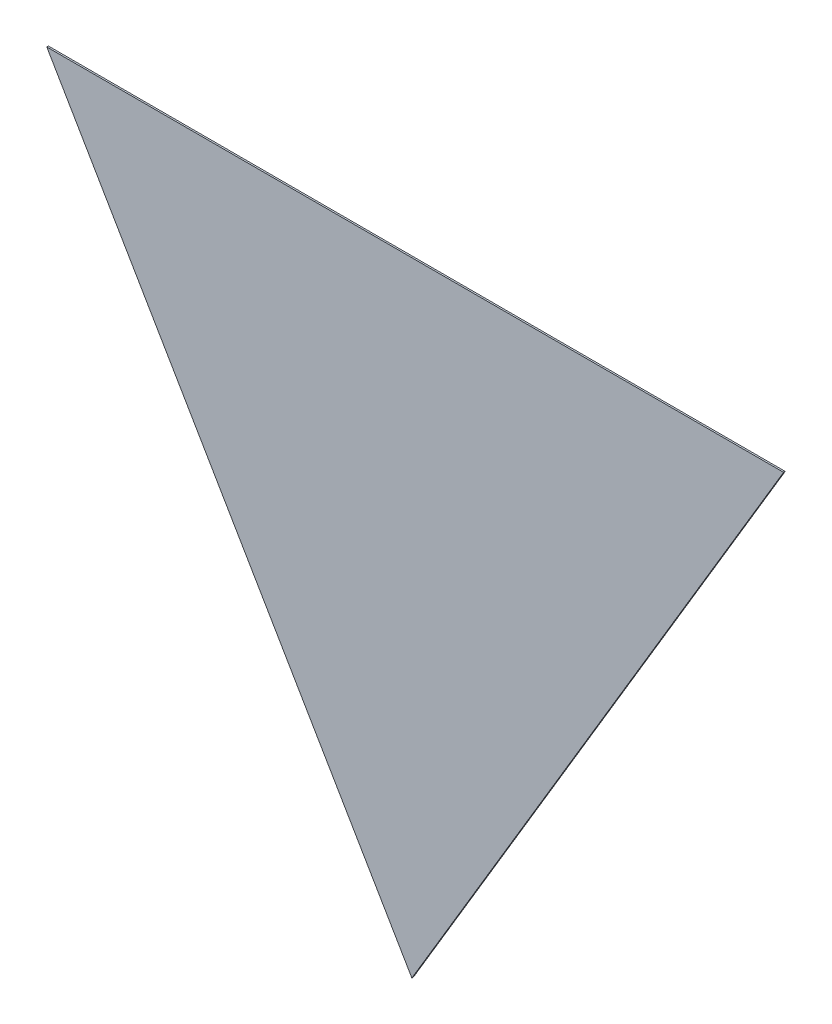
ISO-10303-21;
HEADER;
FILE_DESCRIPTION(('STEP AP214'),'2;1');
FILE_NAME('part.step','',(''),(''),'','','');
FILE_SCHEMA(('AUTOMOTIVE_DESIGN { 1 0 10303 214 1 1 1 1 }'));
ENDSEC;
DATA;
#1=APPLICATION_CONTEXT('core data for automotive mechanical design processes');
#2=APPLICATION_PROTOCOL_DEFINITION('international standard','automotive_design',2000,#1);
#3=PRODUCT_CONTEXT('',#1,'mechanical');
#4=PRODUCT('Part','Part','',(#3));
#5=PRODUCT_RELATED_PRODUCT_CATEGORY('part','',(#4));
#6=PRODUCT_DEFINITION_FORMATION('','',#4);
#7=PRODUCT_DEFINITION_CONTEXT('part definition',#1,'design');
#8=PRODUCT_DEFINITION('design','',#6,#7);
#9=PRODUCT_DEFINITION_SHAPE('','',#8);
#10=(LENGTH_UNIT() NAMED_UNIT(*) SI_UNIT(.MILLI.,.METRE.));
#11=(NAMED_UNIT(*) PLANE_ANGLE_UNIT() SI_UNIT($,.RADIAN.));
#12=(NAMED_UNIT(*) SI_UNIT($,.STERADIAN.) SOLID_ANGLE_UNIT());
#13=UNCERTAINTY_MEASURE_WITH_UNIT(LENGTH_MEASURE(1.E-05),#10,'distance_accuracy_value','');
#14=(GEOMETRIC_REPRESENTATION_CONTEXT(3) GLOBAL_UNCERTAINTY_ASSIGNED_CONTEXT((#13)) GLOBAL_UNIT_ASSIGNED_CONTEXT((#10,
#11,#12)) REPRESENTATION_CONTEXT('',''));
#15=CARTESIAN_POINT('',(0.,0.,0.));
#16=DIRECTION('',(0.,0.,1.));
#17=DIRECTION('',(1.,0.,0.));
#18=AXIS2_PLACEMENT_3D('',#15,#16,#17);
#19=CARTESIAN_POINT('',(0.0542218282260254,0.390044601167,0.0009));
#20=DIRECTION('',(0.859023340627718,-0.511936422084614,0.));
#21=DIRECTION('',(0.,0.,-1.));
#22=AXIS2_PLACEMENT_3D('',#19,#20,#21);
#23=PLANE('',#22);
#24=DIRECTION('',(0.,0.,1.));
#25=VECTOR('',#24,1.);
#26=CARTESIAN_POINT('',(0.1560287683761,0.5608754583869,0.));
#27=LINE('',#26,#25);
#28=CARTESIAN_POINT('',(0.1560287683761,0.5608754583869,0.));
#29=VERTEX_POINT('',#28);
#30=CARTESIAN_POINT('',(0.1560287683761,0.5608754583869,0.0009));
#31=VERTEX_POINT('',#30);
#32=EDGE_CURVE('E11',#29,#31,#27,.T.);
#33=ORIENTED_EDGE('',*,*,#32,.T.);
#34=DIRECTION('',(-0.511936422084614,-0.859023340627718,0.));
#35=VECTOR('',#34,1.);
#36=CARTESIAN_POINT('',(0.1560287683761,0.5608754583869,0.0009));
#37=LINE('',#36,#35);
#38=CARTESIAN_POINT('',(-0.0475851119240491,0.2192137439471,0.0009));
#39=VERTEX_POINT('',#38);
#40=EDGE_CURVE('E69',#31,#39,#37,.T.);
#41=ORIENTED_EDGE('',*,*,#40,.T.);
#42=DIRECTION('',(0.,0.,1.));
#43=VECTOR('',#42,1.);
#44=CARTESIAN_POINT('',(-0.0475851119240491,0.2192137439471,0.));
#45=LINE('',#44,#43);
#46=CARTESIAN_POINT('',(-0.0475851119240491,0.2192137439471,0.));
#47=VERTEX_POINT('',#46);
#48=EDGE_CURVE('E24',#47,#39,#45,.T.);
#49=ORIENTED_EDGE('',*,*,#48,.F.);
#50=DIRECTION('',(-0.511936422084614,-0.859023340627718,0.));
#51=VECTOR('',#50,1.);
#52=CARTESIAN_POINT('',(0.1560287683761,0.5608754583869,0.));
#53=LINE('',#52,#51);
#54=EDGE_CURVE('E47',#29,#47,#53,.T.);
#55=ORIENTED_EDGE('',*,*,#54,.F.);
#56=EDGE_LOOP('',(#33,#41,#49,#55));
#57=FACE_BOUND('',#56,.T.);
#58=ADVANCED_FACE('F17',(#57),#23,.T.);
#59=CARTESIAN_POINT('',(-0.147563556874025,0.390044601167,0.0009));
#60=DIRECTION('',(-0.863058750862992,-0.505103546373229,0.));
#61=DIRECTION('',(0.,0.,1.));
#62=AXIS2_PLACEMENT_3D('',#59,#60,#61);
#63=PLANE('',#62);
#64=ORIENTED_EDGE('',*,*,#48,.T.);
#65=DIRECTION('',(-0.505103546373229,0.863058750862991,0.));
#66=VECTOR('',#65,1.);
#67=CARTESIAN_POINT('',(-0.0475851119240491,0.2192137439471,0.0009));
#68=LINE('',#67,#66);
#69=CARTESIAN_POINT('',(-0.247542001824,0.5608754583869,0.0009));
#70=VERTEX_POINT('',#69);
#71=EDGE_CURVE('E51',#39,#70,#68,.T.);
#72=ORIENTED_EDGE('',*,*,#71,.T.);
#73=DIRECTION('',(0.,0.,1.));
#74=VECTOR('',#73,1.);
#75=CARTESIAN_POINT('',(-0.247542001824,0.5608754583869,0.));
#76=LINE('',#75,#74);
#77=CARTESIAN_POINT('',(-0.247542001824,0.5608754583869,0.));
#78=VERTEX_POINT('',#77);
#79=EDGE_CURVE('E67',#78,#70,#76,.T.);
#80=ORIENTED_EDGE('',*,*,#79,.F.);
#81=DIRECTION('',(-0.505103546373229,0.863058750862991,0.));
#82=VECTOR('',#81,1.);
#83=CARTESIAN_POINT('',(-0.0475851119240491,0.2192137439471,0.));
#84=LINE('',#83,#82);
#85=EDGE_CURVE('E61',#47,#78,#84,.T.);
#86=ORIENTED_EDGE('',*,*,#85,.F.);
#87=EDGE_LOOP('',(#64,#72,#80,#86));
#88=FACE_BOUND('',#87,.T.);
#89=ADVANCED_FACE('F73',(#88),#63,.T.);
#90=CARTESIAN_POINT('',(-0.0457566167239502,0.5608754583869,0.0009));
#91=DIRECTION('',(0.,1.,0.));
#92=DIRECTION('',(0.,0.,1.));
#93=AXIS2_PLACEMENT_3D('',#90,#91,#92);
#94=PLANE('',#93);
#95=ORIENTED_EDGE('',*,*,#79,.T.);
#96=DIRECTION('',(1.,0.,0.));
#97=VECTOR('',#96,1.);
#98=CARTESIAN_POINT('',(-0.247542001824,0.5608754583869,0.0009));
#99=LINE('',#98,#97);
#100=EDGE_CURVE('E52',#70,#31,#99,.T.);
#101=ORIENTED_EDGE('',*,*,#100,.T.);
#102=ORIENTED_EDGE('',*,*,#32,.F.);
#103=DIRECTION('',(1.,0.,0.));
#104=VECTOR('',#103,1.);
#105=CARTESIAN_POINT('',(-0.247542001824,0.5608754583869,0.));
#106=LINE('',#105,#104);
#107=EDGE_CURVE('E57',#78,#29,#106,.T.);
#108=ORIENTED_EDGE('',*,*,#107,.F.);
#109=EDGE_LOOP('',(#95,#101,#102,#108));
#110=FACE_BOUND('',#109,.T.);
#111=ADVANCED_FACE('F56',(#110),#94,.T.);
#112=CARTESIAN_POINT('',(-0.0457566167239502,0.2192137439471,0.));
#113=DIRECTION('',(0.,0.,1.));
#114=DIRECTION('',(1.,0.,0.));
#115=AXIS2_PLACEMENT_3D('',#112,#113,#114);
#116=PLANE('',#115);
#117=ORIENTED_EDGE('',*,*,#54,.T.);
#118=ORIENTED_EDGE('',*,*,#85,.T.);
#119=ORIENTED_EDGE('',*,*,#107,.T.);
#120=EDGE_LOOP('',(#117,#118,#119));
#121=FACE_BOUND('',#120,.T.);
#122=ADVANCED_FACE('F60',(#121),#116,.F.);
#123=CARTESIAN_POINT('',(-0.0457566167239502,0.2192137439471,0.0009));
#124=DIRECTION('',(0.,0.,1.));
#125=DIRECTION('',(1.,0.,0.));
#126=AXIS2_PLACEMENT_3D('',#123,#124,#125);
#127=PLANE('',#126);
#128=ORIENTED_EDGE('',*,*,#40,.F.);
#129=ORIENTED_EDGE('',*,*,#100,.F.);
#130=ORIENTED_EDGE('',*,*,#71,.F.);
#131=EDGE_LOOP('',(#128,#129,#130));
#132=FACE_BOUND('',#131,.T.);
#133=ADVANCED_FACE('F72',(#132),#127,.T.);
#134=CLOSED_SHELL('',(#58,#89,#111,#122,#133));
#135=MANIFOLD_SOLID_BREP('B1',#134);
#136=ADVANCED_BREP_SHAPE_REPRESENTATION('',(#18,#135),#14);
#137=SHAPE_DEFINITION_REPRESENTATION(#9,#136);
ENDSEC;
END-ISO-10303-21;
